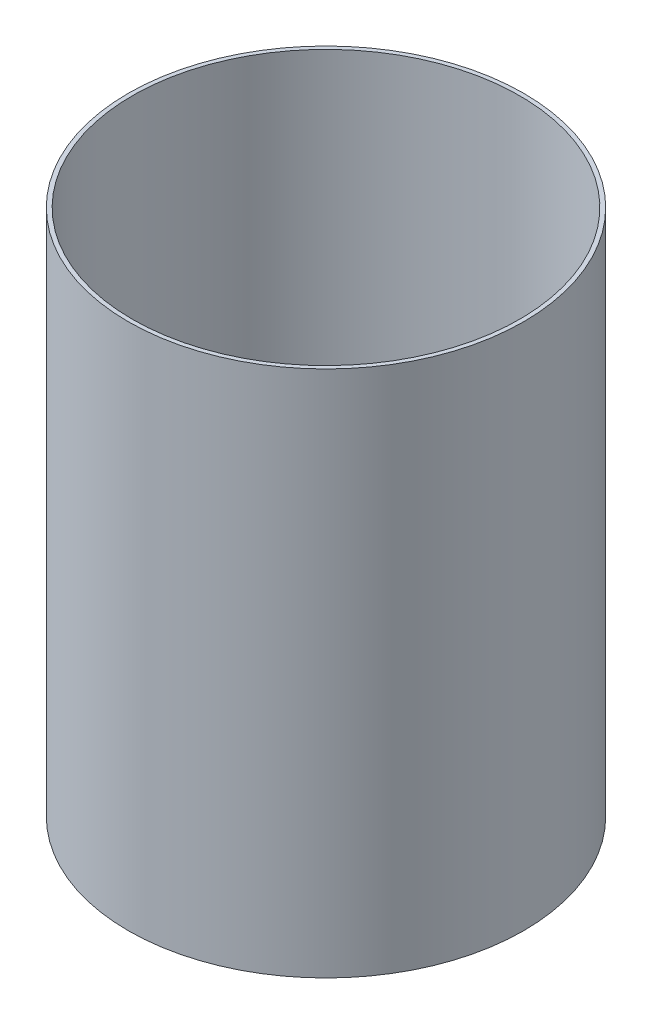
ISO-10303-21;
HEADER;
FILE_DESCRIPTION(('STEP AP214'),'2;1');
FILE_NAME('part.step','',(''),(''),'','','');
FILE_SCHEMA(('AUTOMOTIVE_DESIGN { 1 0 10303 214 1 1 1 1 }'));
ENDSEC;
DATA;
#1=APPLICATION_CONTEXT('core data for automotive mechanical design processes');
#2=APPLICATION_PROTOCOL_DEFINITION('international standard','automotive_design',2000,#1);
#3=PRODUCT_CONTEXT('',#1,'mechanical');
#4=PRODUCT('Part','Part','',(#3));
#5=PRODUCT_RELATED_PRODUCT_CATEGORY('part','',(#4));
#6=PRODUCT_DEFINITION_FORMATION('','',#4);
#7=PRODUCT_DEFINITION_CONTEXT('part definition',#1,'design');
#8=PRODUCT_DEFINITION('design','',#6,#7);
#9=PRODUCT_DEFINITION_SHAPE('','',#8);
#10=(LENGTH_UNIT() NAMED_UNIT(*) SI_UNIT(.MILLI.,.METRE.));
#11=(NAMED_UNIT(*) PLANE_ANGLE_UNIT() SI_UNIT($,.RADIAN.));
#12=(NAMED_UNIT(*) SI_UNIT($,.STERADIAN.) SOLID_ANGLE_UNIT());
#13=UNCERTAINTY_MEASURE_WITH_UNIT(LENGTH_MEASURE(1.E-05),#10,'distance_accuracy_value','');
#14=(GEOMETRIC_REPRESENTATION_CONTEXT(3) GLOBAL_UNCERTAINTY_ASSIGNED_CONTEXT((#13)) GLOBAL_UNIT_ASSIGNED_CONTEXT((#10,
#11,#12)) REPRESENTATION_CONTEXT('',''));
#15=CARTESIAN_POINT('',(0.,0.,0.));
#16=DIRECTION('',(0.,0.,1.));
#17=DIRECTION('',(1.,0.,0.));
#18=AXIS2_PLACEMENT_3D('',#15,#16,#17);
#19=CARTESIAN_POINT('',(0.,406.4,0.));
#20=DIRECTION('',(0.,1.,0.));
#21=DIRECTION('',(0.,0.,1.));
#22=AXIS2_PLACEMENT_3D('',#19,#20,#21);
#23=PLANE('',#22);
#24=CARTESIAN_POINT('',(0.,406.4,0.));
#25=DIRECTION('',(0.,1.,0.));
#26=DIRECTION('',(0.,0.,1.));
#27=AXIS2_PLACEMENT_3D('',#24,#25,#26);
#28=CIRCLE('',#27,152.4);
#29=CARTESIAN_POINT('',(0.,406.4,152.4));
#30=VERTEX_POINT('',#29);
#31=EDGE_CURVE('E10',#30,#30,#28,.T.);
#32=ORIENTED_EDGE('',*,*,#31,.T.);
#33=EDGE_LOOP('',(#32));
#34=FACE_BOUND('',#33,.T.);
#35=CARTESIAN_POINT('',(0.,406.4,0.));
#36=DIRECTION('',(0.,1.,0.));
#37=DIRECTION('',(0.,0.,1.));
#38=AXIS2_PLACEMENT_3D('',#35,#36,#37);
#39=CIRCLE('',#38,149.225);
#40=CARTESIAN_POINT('',(0.,406.4,149.225));
#41=VERTEX_POINT('',#40);
#42=EDGE_CURVE('E42',#41,#41,#39,.T.);
#43=ORIENTED_EDGE('',*,*,#42,.F.);
#44=EDGE_LOOP('',(#43));
#45=FACE_BOUND('',#44,.T.);
#46=ADVANCED_FACE('F31',(#34,#45),#23,.T.);
#47=CARTESIAN_POINT('',(0.,0.,0.));
#48=DIRECTION('',(0.,1.,0.));
#49=DIRECTION('',(0.,0.,1.));
#50=AXIS2_PLACEMENT_3D('',#47,#48,#49);
#51=PLANE('',#50);
#52=CARTESIAN_POINT('',(0.,0.,0.));
#53=DIRECTION('',(0.,1.,0.));
#54=DIRECTION('',(0.,0.,1.));
#55=AXIS2_PLACEMENT_3D('',#52,#53,#54);
#56=CIRCLE('',#55,152.4);
#57=CARTESIAN_POINT('',(0.,0.,152.4));
#58=VERTEX_POINT('',#57);
#59=EDGE_CURVE('E35',#58,#58,#56,.T.);
#60=ORIENTED_EDGE('',*,*,#59,.F.);
#61=EDGE_LOOP('',(#60));
#62=FACE_BOUND('',#61,.T.);
#63=CARTESIAN_POINT('',(0.,0.,0.));
#64=DIRECTION('',(0.,1.,0.));
#65=DIRECTION('',(0.,0.,1.));
#66=AXIS2_PLACEMENT_3D('',#63,#64,#65);
#67=CIRCLE('',#66,149.225);
#68=CARTESIAN_POINT('',(0.,0.,149.225));
#69=VERTEX_POINT('',#68);
#70=EDGE_CURVE('E44',#69,#69,#67,.T.);
#71=ORIENTED_EDGE('',*,*,#70,.T.);
#72=EDGE_LOOP('',(#71));
#73=FACE_BOUND('',#72,.T.);
#74=ADVANCED_FACE('F54',(#62,#73),#51,.F.);
#75=CARTESIAN_POINT('',(0.,406.4,0.));
#76=DIRECTION('',(0.,-1.,0.));
#77=DIRECTION('',(0.,0.,-1.));
#78=AXIS2_PLACEMENT_3D('',#75,#76,#77);
#79=CYLINDRICAL_SURFACE('',#78,152.4);
#80=ORIENTED_EDGE('',*,*,#31,.F.);
#81=EDGE_LOOP('',(#80));
#82=FACE_BOUND('',#81,.T.);
#83=ORIENTED_EDGE('',*,*,#59,.T.);
#84=EDGE_LOOP('',(#83));
#85=FACE_BOUND('',#84,.T.);
#86=ADVANCED_FACE('F33',(#82,#85),#79,.T.);
#87=CARTESIAN_POINT('',(0.,406.4,0.));
#88=DIRECTION('',(0.,-1.,0.));
#89=DIRECTION('',(0.,0.,-1.));
#90=AXIS2_PLACEMENT_3D('',#87,#88,#89);
#91=CYLINDRICAL_SURFACE('',#90,149.225);
#92=ORIENTED_EDGE('',*,*,#42,.T.);
#93=EDGE_LOOP('',(#92));
#94=FACE_BOUND('',#93,.T.);
#95=ORIENTED_EDGE('',*,*,#70,.F.);
#96=EDGE_LOOP('',(#95));
#97=FACE_BOUND('',#96,.T.);
#98=ADVANCED_FACE('F50',(#94,#97),#91,.F.);
#99=CLOSED_SHELL('',(#46,#74,#86,#98));
#100=MANIFOLD_SOLID_BREP('B2',#99);
#101=ADVANCED_BREP_SHAPE_REPRESENTATION('',(#18,#100),#14);
#102=SHAPE_DEFINITION_REPRESENTATION(#9,#101);
ENDSEC;
END-ISO-10303-21;
